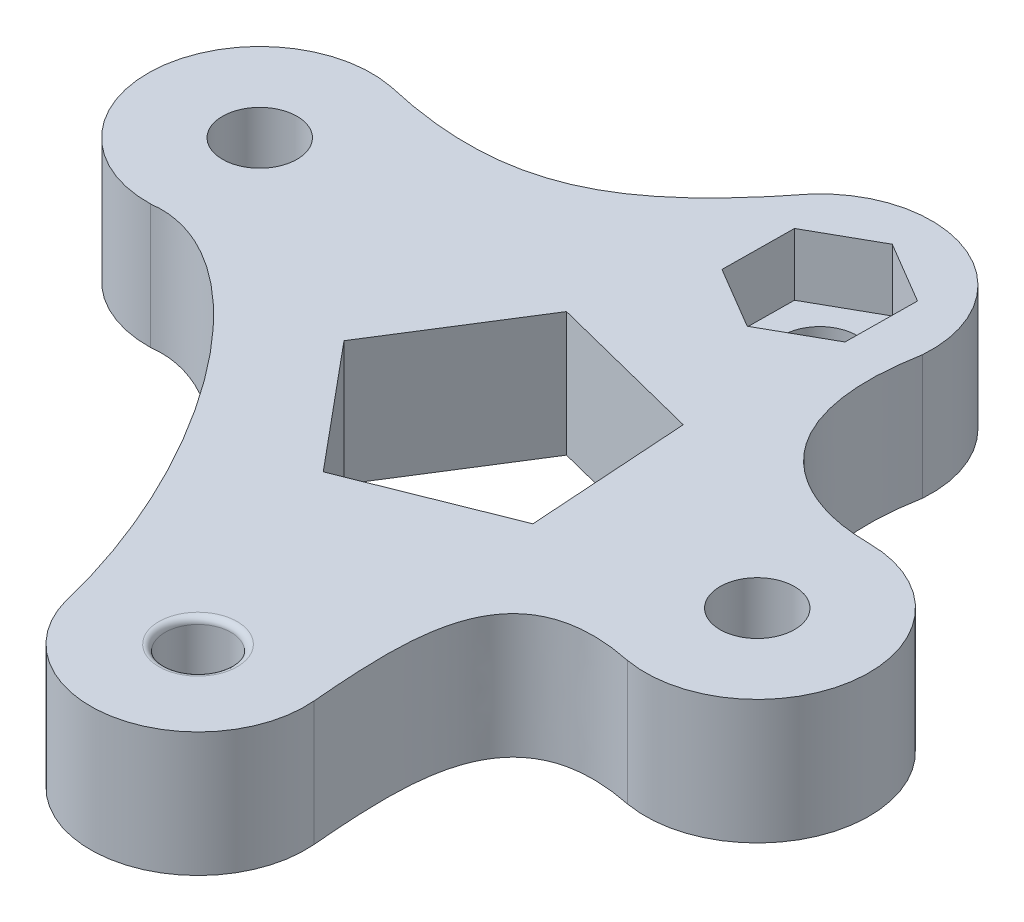
ISO-10303-21;
HEADER;
FILE_DESCRIPTION(('STEP AP214'),'2;1');
FILE_NAME('part.step','',(''),(''),'','','');
FILE_SCHEMA(('AUTOMOTIVE_DESIGN { 1 0 10303 214 1 1 1 1 }'));
ENDSEC;
DATA;
#1=APPLICATION_CONTEXT('core data for automotive mechanical design processes');
#2=APPLICATION_PROTOCOL_DEFINITION('international standard','automotive_design',2000,#1);
#3=PRODUCT_CONTEXT('',#1,'mechanical');
#4=PRODUCT('Part','Part','',(#3));
#5=PRODUCT_RELATED_PRODUCT_CATEGORY('part','',(#4));
#6=PRODUCT_DEFINITION_FORMATION('','',#4);
#7=PRODUCT_DEFINITION_CONTEXT('part definition',#1,'design');
#8=PRODUCT_DEFINITION('design','',#6,#7);
#9=PRODUCT_DEFINITION_SHAPE('','',#8);
#10=(LENGTH_UNIT() NAMED_UNIT(*) SI_UNIT(.MILLI.,.METRE.));
#11=(NAMED_UNIT(*) PLANE_ANGLE_UNIT() SI_UNIT($,.RADIAN.));
#12=(NAMED_UNIT(*) SI_UNIT($,.STERADIAN.) SOLID_ANGLE_UNIT());
#13=UNCERTAINTY_MEASURE_WITH_UNIT(LENGTH_MEASURE(1.E-05),#10,'distance_accuracy_value','');
#14=(GEOMETRIC_REPRESENTATION_CONTEXT(3) GLOBAL_UNCERTAINTY_ASSIGNED_CONTEXT((#13)) GLOBAL_UNIT_ASSIGNED_CONTEXT((#10,
#11,#12)) REPRESENTATION_CONTEXT('',''));
#15=CARTESIAN_POINT('',(0.,0.,0.));
#16=DIRECTION('',(0.,0.,1.));
#17=DIRECTION('',(1.,0.,0.));
#18=AXIS2_PLACEMENT_3D('',#15,#16,#17);
#19=CARTESIAN_POINT('',(0.,9.5,0.));
#20=DIRECTION('',(0.,1.,0.));
#21=DIRECTION('',(0.,0.,1.));
#22=AXIS2_PLACEMENT_3D('',#19,#20,#21);
#23=TOROIDAL_SURFACE('',#22,3.15,0.5);
#24=CARTESIAN_POINT('',(0.,10.,0.));
#25=DIRECTION('',(0.,1.,0.));
#26=DIRECTION('',(0.,0.,1.));
#27=AXIS2_PLACEMENT_3D('',#24,#25,#26);
#28=CIRCLE('',#27,3.15);
#29=CARTESIAN_POINT('',(0.,10.,3.15));
#30=VERTEX_POINT('',#29);
#31=EDGE_CURVE('E44',#30,#30,#28,.F.);
#32=ORIENTED_EDGE('',*,*,#31,.F.);
#33=EDGE_LOOP('',(#32));
#34=FACE_BOUND('',#33,.T.);
#35=CARTESIAN_POINT('',(0.,9.5,0.));
#36=DIRECTION('',(0.,1.,0.));
#37=DIRECTION('',(0.,0.,1.));
#38=AXIS2_PLACEMENT_3D('',#35,#36,#37);
#39=CIRCLE('',#38,2.65);
#40=CARTESIAN_POINT('',(0.,9.5,2.65));
#41=VERTEX_POINT('',#40);
#42=EDGE_CURVE('E11',#41,#41,#39,.T.);
#43=ORIENTED_EDGE('',*,*,#42,.F.);
#44=EDGE_LOOP('',(#43));
#45=FACE_BOUND('',#44,.T.);
#46=ADVANCED_FACE('F37',(#34,#45),#23,.T.);
#47=CARTESIAN_POINT('',(0.,0.5,0.));
#48=DIRECTION('',(0.,1.,0.));
#49=DIRECTION('',(0.,0.,1.));
#50=AXIS2_PLACEMENT_3D('',#47,#48,#49);
#51=TOROIDAL_SURFACE('',#50,3.15,0.5);
#52=CARTESIAN_POINT('',(0.,0.,0.));
#53=DIRECTION('',(0.,1.,0.));
#54=DIRECTION('',(0.,0.,1.));
#55=AXIS2_PLACEMENT_3D('',#52,#53,#54);
#56=CIRCLE('',#55,3.15);
#57=CARTESIAN_POINT('',(0.,0.,3.15));
#58=VERTEX_POINT('',#57);
#59=EDGE_CURVE('E252',#58,#58,#56,.T.);
#60=ORIENTED_EDGE('',*,*,#59,.F.);
#61=EDGE_LOOP('',(#60));
#62=FACE_BOUND('',#61,.T.);
#63=CARTESIAN_POINT('',(0.,0.5,0.));
#64=DIRECTION('',(0.,1.,0.));
#65=DIRECTION('',(0.,0.,1.));
#66=AXIS2_PLACEMENT_3D('',#63,#64,#65);
#67=CIRCLE('',#66,2.65);
#68=CARTESIAN_POINT('',(0.,0.5,2.65));
#69=VERTEX_POINT('',#68);
#70=EDGE_CURVE('E274',#69,#69,#67,.F.);
#71=ORIENTED_EDGE('',*,*,#70,.F.);
#72=EDGE_LOOP('',(#71));
#73=FACE_BOUND('',#72,.T.);
#74=ADVANCED_FACE('F283',(#62,#73),#51,.T.);
#75=CARTESIAN_POINT('',(0.,10.,-50.));
#76=DIRECTION('',(0.,-1.,0.));
#77=DIRECTION('',(0.,0.,-1.));
#78=AXIS2_PLACEMENT_3D('',#75,#76,#77);
#79=CYLINDRICAL_SURFACE('',#78,3.);
#80=CARTESIAN_POINT('',(0.,0.,-50.));
#81=DIRECTION('',(0.,1.,0.));
#82=DIRECTION('',(0.,0.,1.));
#83=AXIS2_PLACEMENT_3D('',#80,#81,#82);
#84=CIRCLE('',#83,3.);
#85=CARTESIAN_POINT('',(0.,0.,-47.));
#86=VERTEX_POINT('',#85);
#87=EDGE_CURVE('E240',#86,#86,#84,.T.);
#88=ORIENTED_EDGE('',*,*,#87,.F.);
#89=EDGE_LOOP('',(#88));
#90=FACE_BOUND('',#89,.T.);
#91=CARTESIAN_POINT('',(0.,5.,-50.));
#92=DIRECTION('',(0.,1.,0.));
#93=DIRECTION('',(0.,0.,1.));
#94=AXIS2_PLACEMENT_3D('',#91,#92,#93);
#95=CIRCLE('',#94,3.);
#96=CARTESIAN_POINT('',(0.,5.,-47.));
#97=VERTEX_POINT('',#96);
#98=EDGE_CURVE('E189',#97,#97,#95,.T.);
#99=ORIENTED_EDGE('',*,*,#98,.T.);
#100=EDGE_LOOP('',(#99));
#101=FACE_BOUND('',#100,.T.);
#102=ADVANCED_FACE('F295',(#90,#101),#79,.F.);
#103=CARTESIAN_POINT('',(6.49848751845895,10.,-0.429456596579437));
#104=DIRECTION('',(-0.997823471803011,0.,0.0659417858340704));
#105=DIRECTION('',(0.0659417858340704,0.,0.997823471803011));
#106=AXIS2_PLACEMENT_3D('',#103,#104,#105);
#107=PLANE('',#106);
#108=DIRECTION('',(-0.0659417858340704,0.,-0.997823471803011));
#109=VECTOR('',#108,1.);
#110=CARTESIAN_POINT('',(6.49848751845895,0.,-0.429456596579437));
#111=LINE('',#110,#109);
#112=CARTESIAN_POINT('',(5.08295150552818,0.,-21.8491837243666));
#113=VERTEX_POINT('',#112);
#114=CARTESIAN_POINT('',(4.22740424267535,0.,-34.7952258934323));
#115=VERTEX_POINT('',#114);
#116=EDGE_CURVE('E229',#113,#115,#111,.T.);
#117=ORIENTED_EDGE('',*,*,#116,.F.);
#118=DIRECTION('',(0.,-1.,0.));
#119=VECTOR('',#118,1.);
#120=CARTESIAN_POINT('',(5.08295150552818,10.,-21.8491837243666));
#121=LINE('',#120,#119);
#122=CARTESIAN_POINT('',(5.08295150552818,10.,-21.8491837243666));
#123=VERTEX_POINT('',#122);
#124=EDGE_CURVE('E250',#123,#113,#121,.T.);
#125=ORIENTED_EDGE('',*,*,#124,.F.);
#126=DIRECTION('',(-0.0659417858340704,0.,-0.997823471803011));
#127=VECTOR('',#126,1.);
#128=CARTESIAN_POINT('',(6.49848751845895,10.,-0.429456596579437));
#129=LINE('',#128,#127);
#130=CARTESIAN_POINT('',(4.22740424267535,10.,-34.7952258934323));
#131=VERTEX_POINT('',#130);
#132=EDGE_CURVE('E518',#123,#131,#129,.T.);
#133=ORIENTED_EDGE('',*,*,#132,.T.);
#134=DIRECTION('',(0.,-1.,0.));
#135=VECTOR('',#134,1.);
#136=CARTESIAN_POINT('',(4.22740424267535,10.,-34.7952258934323));
#137=LINE('',#136,#135);
#138=EDGE_CURVE('E60',#131,#115,#137,.T.);
#139=ORIENTED_EDGE('',*,*,#138,.T.);
#140=EDGE_LOOP('',(#117,#125,#133,#139));
#141=FACE_BOUND('',#140,.T.);
#142=ADVANCED_FACE('F300',(#141),#107,.T.);
#143=CARTESIAN_POINT('',(-6.82869974256127,10.,-17.0894614912974));
#144=DIRECTION('',(-0.371058775286974,0.,-0.928609382508346));
#145=DIRECTION('',(-0.928609382508346,0.,0.371058775286974));
#146=AXIS2_PLACEMENT_3D('',#143,#144,#145);
#147=PLANE('',#146);
#148=DIRECTION('',(0.928609382508346,0.,-0.371058775286974));
#149=VECTOR('',#148,1.);
#150=CARTESIAN_POINT('',(-6.82869974256127,0.,-17.0894614912974));
#151=LINE('',#150,#149);
#152=CARTESIAN_POINT('',(-6.96508761588114,0.,-17.0349628848959));
#153=VERTEX_POINT('',#152);
#154=EDGE_CURVE('E231',#153,#113,#151,.T.);
#155=ORIENTED_EDGE('',*,*,#154,.F.);
#156=DIRECTION('',(0.,-1.,0.));
#157=VECTOR('',#156,1.);
#158=CARTESIAN_POINT('',(-6.96508761588114,10.,-17.0349628848959));
#159=LINE('',#158,#157);
#160=CARTESIAN_POINT('',(-6.96508761588114,10.,-17.0349628848959));
#161=VERTEX_POINT('',#160);
#162=EDGE_CURVE('E159',#161,#153,#159,.T.);
#163=ORIENTED_EDGE('',*,*,#162,.F.);
#164=DIRECTION('',(0.928609382508346,0.,-0.371058775286974));
#165=VECTOR('',#164,1.);
#166=CARTESIAN_POINT('',(-6.82869974256127,10.,-17.0894614912974));
#167=LINE('',#166,#165);
#168=EDGE_CURVE('E171',#161,#123,#167,.T.);
#169=ORIENTED_EDGE('',*,*,#168,.T.);
#170=ORIENTED_EDGE('',*,*,#124,.T.);
#171=EDGE_LOOP('',(#155,#163,#169,#170));
#172=FACE_BOUND('',#171,.T.);
#173=ADVANCED_FACE('F383',(#172),#147,.T.);
#174=CARTESIAN_POINT('',(4.26303666465518,10.,-3.54942501772673));
#175=DIRECTION('',(0.768496536851751,0.,-0.63985394649628));
#176=DIRECTION('',(-0.63985394649628,0.,-0.768496536851751));
#177=AXIS2_PLACEMENT_3D('',#174,#175,#176);
#178=PLANE('',#177);
#179=DIRECTION('',(0.63985394649628,0.,0.768496536851751));
#180=VECTOR('',#179,1.);
#181=CARTESIAN_POINT('',(4.26303666465518,0.,-3.54942501772673));
#182=LINE('',#181,#180);
#183=CARTESIAN_POINT('',(-15.2667325535534,0.,-27.0056529458207));
#184=VERTEX_POINT('',#183);
#185=EDGE_CURVE('E154',#184,#153,#182,.T.);
#186=ORIENTED_EDGE('',*,*,#185,.F.);
#187=DIRECTION('',(0.,-1.,0.));
#188=VECTOR('',#187,1.);
#189=CARTESIAN_POINT('',(-15.2667325535534,10.,-27.0056529458207));
#190=LINE('',#189,#188);
#191=CARTESIAN_POINT('',(-15.2667325535534,10.,-27.0056529458207));
#192=VERTEX_POINT('',#191);
#193=EDGE_CURVE('E149',#192,#184,#190,.T.);
#194=ORIENTED_EDGE('',*,*,#193,.F.);
#195=DIRECTION('',(0.63985394649628,0.,0.768496536851751));
#196=VECTOR('',#195,1.);
#197=CARTESIAN_POINT('',(4.26303666465518,10.,-3.54942501772673));
#198=LINE('',#197,#196);
#199=EDGE_CURVE('E152',#192,#161,#198,.T.);
#200=ORIENTED_EDGE('',*,*,#199,.T.);
#201=ORIENTED_EDGE('',*,*,#162,.T.);
#202=EDGE_LOOP('',(#186,#194,#200,#201));
#203=FACE_BOUND('',#202,.T.);
#204=ADVANCED_FACE('F151',(#203),#178,.T.);
#205=CARTESIAN_POINT('',(-23.1082210138306,10.,-14.5627671976878));
#206=DIRECTION('',(0.846015755297943,0.,0.533157895737887));
#207=DIRECTION('',(0.533157895737887,0.,-0.846015755297943));
#208=AXIS2_PLACEMENT_3D('',#205,#206,#207);
#209=PLANE('',#208);
#210=DIRECTION('',(-0.533157895737887,0.,0.846015755297943));
#211=VECTOR('',#210,1.);
#212=CARTESIAN_POINT('',(-23.1082210138306,0.,-14.5627671976878));
#213=LINE('',#212,#211);
#214=CARTESIAN_POINT('',(-8.34939216615898,0.,-37.9820991342337));
#215=VERTEX_POINT('',#214);
#216=EDGE_CURVE('E235',#215,#184,#213,.T.);
#217=ORIENTED_EDGE('',*,*,#216,.F.);
#218=DIRECTION('',(0.,-1.,0.));
#219=VECTOR('',#218,1.);
#220=CARTESIAN_POINT('',(-8.34939216615898,10.,-37.9820991342337));
#221=LINE('',#220,#219);
#222=CARTESIAN_POINT('',(-8.34939216615898,10.,-37.9820991342337));
#223=VERTEX_POINT('',#222);
#224=EDGE_CURVE('E160',#223,#215,#221,.T.);
#225=ORIENTED_EDGE('',*,*,#224,.F.);
#226=DIRECTION('',(-0.533157895737887,0.,0.846015755297943));
#227=VECTOR('',#226,1.);
#228=CARTESIAN_POINT('',(-23.1082210138306,10.,-14.5627671976878));
#229=LINE('',#228,#227);
#230=EDGE_CURVE('E169',#223,#192,#229,.T.);
#231=ORIENTED_EDGE('',*,*,#230,.T.);
#232=ORIENTED_EDGE('',*,*,#193,.T.);
#233=EDGE_LOOP('',(#217,#225,#231,#232));
#234=FACE_BOUND('',#233,.T.);
#235=ADVANCED_FACE('F173',(#234),#209,.T.);
#236=CARTESIAN_POINT('',(18.4152010642432,10.,-16.1361929124947));
#237=CARTESIAN_POINT('',(8.09980421145363,10.,-18.2782159029591));
#238=CARTESIAN_POINT('',(7.88377715331091,10.,-5.86827617151024));
#239=CARTESIAN_POINT('',(9.15507635758057,10.,4.83149193183385));
#240=CARTESIAN_POINT('',(10.8046231713954,10.,6.29322049876016));
#241=B_SPLINE_CURVE_WITH_KNOTS('',3,(#236,#237,#238,#239,#240),.UNSPECIFIED.,.F.,.F.,(4,1,4),
(0.,0.640184331831748,1.),.UNSPECIFIED.);
#242=DIRECTION('',(0.,-1.,0.));
#243=VECTOR('',#242,1.);
#244=SURFACE_OF_LINEAR_EXTRUSION('',#241,#243);
#245=CARTESIAN_POINT('',(18.4152010642432,0.,-16.1361929124947));
#246=CARTESIAN_POINT('',(8.09980421145363,0.,-18.2782159029591));
#247=CARTESIAN_POINT('',(7.88377715331091,0.,-5.86827617151024));
#248=CARTESIAN_POINT('',(9.15507635758057,0.,4.83149193183385));
#249=CARTESIAN_POINT('',(10.8046231713954,0.,6.29322049876016));
#250=B_SPLINE_CURVE_WITH_KNOTS('',3,(#245,#246,#247,#248,#249),.UNSPECIFIED.,.F.,.F.,(4,1,4),
(0.,0.640184331831748,1.),.UNSPECIFIED.);
#251=CARTESIAN_POINT('',(18.4152010642432,0.,-16.1361929124947));
#252=VERTEX_POINT('',#251);
#253=CARTESIAN_POINT('',(8.62015601704226,0.,-0.7179207768621));
#254=VERTEX_POINT('',#253);
#255=EDGE_CURVE('E183',#252,#254,#250,.T.);
#256=ORIENTED_EDGE('',*,*,#255,.F.);
#257=DIRECTION('',(0.,-1.,0.));
#258=VECTOR('',#257,1.);
#259=CARTESIAN_POINT('',(18.4152010642432,10.,-16.1361929124947));
#260=LINE('',#259,#258);
#261=CARTESIAN_POINT('',(18.4152010642432,10.,-16.1361929124947));
#262=VERTEX_POINT('',#261);
#263=EDGE_CURVE('E114',#262,#252,#260,.T.);
#264=ORIENTED_EDGE('',*,*,#263,.F.);
#265=CARTESIAN_POINT('',(8.62015601704226,10.,-0.7179207768621));
#266=VERTEX_POINT('',#265);
#267=EDGE_CURVE('E246',#262,#266,#241,.T.);
#268=ORIENTED_EDGE('',*,*,#267,.T.);
#269=DIRECTION('',(0.,-1.,0.));
#270=VECTOR('',#269,1.);
#271=CARTESIAN_POINT('',(8.62015601704226,10.,-0.7179207768621));
#272=LINE('',#271,#270);
#273=EDGE_CURVE('E182',#266,#254,#272,.T.);
#274=ORIENTED_EDGE('',*,*,#273,.T.);
#275=EDGE_LOOP('',(#256,#264,#268,#274));
#276=FACE_BOUND('',#275,.T.);
#277=ADVANCED_FACE('F305',(#276),#244,.T.);
#278=CARTESIAN_POINT('',(19.9749843554382,10.,-25.));
#279=DIRECTION('',(0.,-1.,0.));
#280=DIRECTION('',(0.,0.,-1.));
#281=AXIS2_PLACEMENT_3D('',#278,#279,#280);
#282=CYLINDRICAL_SURFACE('',#281,9.00000000000001);
#283=CARTESIAN_POINT('',(19.9749843554382,0.,-25.));
#284=DIRECTION('',(0.,1.,0.));
#285=DIRECTION('',(0.,0.,1.));
#286=AXIS2_PLACEMENT_3D('',#283,#284,#285);
#287=CIRCLE('',#286,9.00000000000001);
#288=CARTESIAN_POINT('',(20.0239779604949,0.,-33.9998666449378));
#289=VERTEX_POINT('',#288);
#290=EDGE_CURVE('E188',#252,#289,#287,.T.);
#291=ORIENTED_EDGE('',*,*,#290,.T.);
#292=DIRECTION('',(0.,-1.,0.));
#293=VECTOR('',#292,1.);
#294=CARTESIAN_POINT('',(20.0239779604949,10.,-33.9998666449378));
#295=LINE('',#294,#293);
#296=CARTESIAN_POINT('',(20.0239779604949,10.,-33.9998666449378));
#297=VERTEX_POINT('',#296);
#298=EDGE_CURVE('E266',#297,#289,#295,.T.);
#299=ORIENTED_EDGE('',*,*,#298,.F.);
#300=CARTESIAN_POINT('',(19.9749843554382,10.,-25.));
#301=DIRECTION('',(0.,1.,0.));
#302=DIRECTION('',(0.,0.,1.));
#303=AXIS2_PLACEMENT_3D('',#300,#301,#302);
#304=CIRCLE('',#303,9.00000000000001);
#305=EDGE_CURVE('E316',#262,#297,#304,.T.);
#306=ORIENTED_EDGE('',*,*,#305,.F.);
#307=ORIENTED_EDGE('',*,*,#263,.T.);
#308=EDGE_LOOP('',(#291,#299,#306,#307));
#309=FACE_BOUND('',#308,.T.);
#310=ADVANCED_FACE('F309',(#309),#282,.T.);
#311=CARTESIAN_POINT('',(8.97317785185828,10.,-49.305680737038));
#312=CARTESIAN_POINT('',(5.49328523217848,10.,-30.5596956335202));
#313=CARTESIAN_POINT('',(26.2667020325121,10.,-31.3291109601468));
#314=CARTESIAN_POINT('',(32.1070484161927,10.,-39.4155715811322));
#315=B_SPLINE_CURVE_WITH_KNOTS('',3,(#311,#312,#313,#314),.UNSPECIFIED.,.F.,.F.,(4,4),(0.,1.),.UNSPECIFIED.);
#316=DIRECTION('',(0.,-1.,0.));
#317=VECTOR('',#316,1.);
#318=SURFACE_OF_LINEAR_EXTRUSION('',#315,#317);
#319=CARTESIAN_POINT('',(8.97317785185828,0.,-49.305680737038));
#320=CARTESIAN_POINT('',(5.49328523217848,0.,-30.5596956335202));
#321=CARTESIAN_POINT('',(26.2667020325121,0.,-31.3291109601468));
#322=CARTESIAN_POINT('',(32.1070484161927,0.,-39.4155715811322));
#323=B_SPLINE_CURVE_WITH_KNOTS('',3,(#319,#320,#321,#322),.UNSPECIFIED.,.F.,.F.,(4,4),(0.,1.),.UNSPECIFIED.);
#324=CARTESIAN_POINT('',(8.97317785185827,0.,-49.305680737038));
#325=VERTEX_POINT('',#324);
#326=EDGE_CURVE('E195',#325,#289,#323,.T.);
#327=ORIENTED_EDGE('',*,*,#326,.F.);
#328=DIRECTION('',(0.,-1.,0.));
#329=VECTOR('',#328,1.);
#330=CARTESIAN_POINT('',(8.97317785185827,10.,-49.305680737038));
#331=LINE('',#330,#329);
#332=CARTESIAN_POINT('',(8.97317785185827,10.,-49.305680737038));
#333=VERTEX_POINT('',#332);
#334=EDGE_CURVE('E264',#333,#325,#331,.T.);
#335=ORIENTED_EDGE('',*,*,#334,.F.);
#336=EDGE_CURVE('E323',#333,#297,#315,.T.);
#337=ORIENTED_EDGE('',*,*,#336,.T.);
#338=ORIENTED_EDGE('',*,*,#298,.T.);
#339=EDGE_LOOP('',(#327,#335,#337,#338));
#340=FACE_BOUND('',#339,.T.);
#341=ADVANCED_FACE('F334',(#340),#318,.T.);
#342=CARTESIAN_POINT('',(0.,10.,-50.));
#343=DIRECTION('',(0.,-1.,0.));
#344=DIRECTION('',(0.,0.,-1.));
#345=AXIS2_PLACEMENT_3D('',#342,#343,#344);
#346=CYLINDRICAL_SURFACE('',#345,9.);
#347=CARTESIAN_POINT('',(0.,0.,-50.));
#348=DIRECTION('',(0.,1.,0.));
#349=DIRECTION('',(0.,0.,1.));
#350=AXIS2_PLACEMENT_3D('',#347,#348,#349);
#351=CIRCLE('',#350,9.);
#352=CARTESIAN_POINT('',(-6.65608852670844,0.,-56.0577624189646));
#353=VERTEX_POINT('',#352);
#354=EDGE_CURVE('E200',#325,#353,#351,.T.);
#355=ORIENTED_EDGE('',*,*,#354,.T.);
#356=DIRECTION('',(0.,-1.,0.));
#357=VECTOR('',#356,1.);
#358=CARTESIAN_POINT('',(-6.65608852670844,10.,-56.0577624189646));
#359=LINE('',#358,#357);
#360=CARTESIAN_POINT('',(-6.65608852670844,10.,-56.0577624189646));
#361=VERTEX_POINT('',#360);
#362=EDGE_CURVE('E262',#361,#353,#359,.T.);
#363=ORIENTED_EDGE('',*,*,#362,.F.);
#364=CARTESIAN_POINT('',(0.,10.,-50.));
#365=DIRECTION('',(0.,1.,0.));
#366=DIRECTION('',(0.,0.,1.));
#367=AXIS2_PLACEMENT_3D('',#364,#365,#366);
#368=CIRCLE('',#367,9.);
#369=EDGE_CURVE('E329',#333,#361,#368,.T.);
#370=ORIENTED_EDGE('',*,*,#369,.F.);
#371=ORIENTED_EDGE('',*,*,#334,.T.);
#372=EDGE_LOOP('',(#355,#363,#370,#371));
#373=FACE_BOUND('',#372,.T.);
#374=ADVANCED_FACE('F337',(#373),#346,.T.);
#375=CARTESIAN_POINT('',(-31.0867246453892,10.,-46.5880795022187));
#376=CARTESIAN_POINT('',(-19.7895746511196,10.,-43.9491521286999));
#377=CARTESIAN_POINT('',(-11.9536081400962,10.,-48.5909069902257));
#378=CARTESIAN_POINT('',(-3.83565772654311,10.,-59.6537636698233));
#379=CARTESIAN_POINT('',(-2.95287471984913,10.,-63.3683133100101));
#380=B_SPLINE_CURVE_WITH_KNOTS('',3,(#375,#376,#377,#378,#379),.UNSPECIFIED.,.F.,.F.,(4,1,4),
(0.,0.709310605275663,1.),.UNSPECIFIED.);
#381=DIRECTION('',(0.,-1.,0.));
#382=VECTOR('',#381,1.);
#383=SURFACE_OF_LINEAR_EXTRUSION('',#380,#382);
#384=CARTESIAN_POINT('',(-31.0867246453892,0.,-46.5880795022187));
#385=CARTESIAN_POINT('',(-19.7895746511196,0.,-43.9491521286999));
#386=CARTESIAN_POINT('',(-11.9536081400962,0.,-48.5909069902257));
#387=CARTESIAN_POINT('',(-3.83565772654311,0.,-59.6537636698233));
#388=CARTESIAN_POINT('',(-2.95287471984913,0.,-63.3683133100101));
#389=B_SPLINE_CURVE_WITH_KNOTS('',3,(#384,#385,#386,#387,#388),.UNSPECIFIED.,.F.,.F.,(4,1,4),
(0.,0.709310605275663,1.),.UNSPECIFIED.);
#390=CARTESIAN_POINT('',(-31.0867246453892,0.,-46.5880795022187));
#391=VERTEX_POINT('',#390);
#392=EDGE_CURVE('E206',#391,#353,#389,.T.);
#393=ORIENTED_EDGE('',*,*,#392,.F.);
#394=DIRECTION('',(0.,-1.,0.));
#395=VECTOR('',#394,1.);
#396=CARTESIAN_POINT('',(-31.0867246453892,10.,-46.5880795022187));
#397=LINE('',#396,#395);
#398=CARTESIAN_POINT('',(-31.0867246453892,10.,-46.5880795022187));
#399=VERTEX_POINT('',#398);
#400=EDGE_CURVE('E260',#399,#391,#397,.T.);
#401=ORIENTED_EDGE('',*,*,#400,.F.);
#402=EDGE_CURVE('E348',#399,#361,#380,.T.);
#403=ORIENTED_EDGE('',*,*,#402,.T.);
#404=ORIENTED_EDGE('',*,*,#362,.T.);
#405=EDGE_LOOP('',(#393,#401,#403,#404));
#406=FACE_BOUND('',#405,.T.);
#407=ADVANCED_FACE('F341',(#406),#383,.T.);
#408=CARTESIAN_POINT('',(-32.7862394915916,10.,-37.75));
#409=DIRECTION('',(0.,-1.,0.));
#410=DIRECTION('',(0.,0.,-1.));
#411=AXIS2_PLACEMENT_3D('',#408,#409,#410);
#412=CYLINDRICAL_SURFACE('',#411,9.);
#413=CARTESIAN_POINT('',(-32.7862394915916,0.,-37.75));
#414=DIRECTION('',(0.,1.,0.));
#415=DIRECTION('',(0.,0.,1.));
#416=AXIS2_PLACEMENT_3D('',#413,#414,#415);
#417=CIRCLE('',#416,9.);
#418=CARTESIAN_POINT('',(-32.5594886375921,0.,-28.7528568950911));
#419=VERTEX_POINT('',#418);
#420=EDGE_CURVE('E211',#391,#419,#417,.T.);
#421=ORIENTED_EDGE('',*,*,#420,.T.);
#422=DIRECTION('',(0.,-1.,0.));
#423=VECTOR('',#422,1.);
#424=CARTESIAN_POINT('',(-32.5594886375921,10.,-28.7528568950911));
#425=LINE('',#424,#423);
#426=CARTESIAN_POINT('',(-32.5594886375921,10.,-28.7528568950911));
#427=VERTEX_POINT('',#426);
#428=EDGE_CURVE('E257',#427,#419,#425,.T.);
#429=ORIENTED_EDGE('',*,*,#428,.F.);
#430=CARTESIAN_POINT('',(-32.7862394915916,10.,-37.75));
#431=DIRECTION('',(0.,1.,0.));
#432=DIRECTION('',(0.,0.,1.));
#433=AXIS2_PLACEMENT_3D('',#430,#431,#432);
#434=CIRCLE('',#433,9.);
#435=EDGE_CURVE('E354',#399,#427,#434,.T.);
#436=ORIENTED_EDGE('',*,*,#435,.F.);
#437=ORIENTED_EDGE('',*,*,#400,.T.);
#438=EDGE_LOOP('',(#421,#429,#436,#437));
#439=FACE_BOUND('',#438,.T.);
#440=ADVANCED_FACE('F345',(#439),#412,.T.);
#441=CARTESIAN_POINT('',(-32.5594886375921,10.,-28.7528568950911));
#442=CARTESIAN_POINT('',(-22.2479273622609,10.,-30.181939372049));
#443=CARTESIAN_POINT('',(-5.43364175966254,10.,-3.44947014054236));
#444=CARTESIAN_POINT('',(-7.48972259740143,10.,13.3840966396793));
#445=B_SPLINE_CURVE_WITH_KNOTS('',3,(#441,#442,#443,#444),.UNSPECIFIED.,.F.,.F.,(4,4),(0.,1.),.UNSPECIFIED.);
#446=DIRECTION('',(0.,-1.,0.));
#447=VECTOR('',#446,1.);
#448=SURFACE_OF_LINEAR_EXTRUSION('',#445,#447);
#449=CARTESIAN_POINT('',(-32.5594886375921,0.,-28.7528568950911));
#450=CARTESIAN_POINT('',(-22.2479273622609,0.,-30.181939372049));
#451=CARTESIAN_POINT('',(-5.43364175966254,0.,-3.44947014054236));
#452=CARTESIAN_POINT('',(-7.48972259740143,0.,13.3840966396793));
#453=B_SPLINE_CURVE_WITH_KNOTS('',3,(#449,#450,#451,#452),.UNSPECIFIED.,.F.,.F.,(4,4),(0.,1.),.UNSPECIFIED.);
#454=CARTESIAN_POINT('',(-8.356742025347,0.,2.23324040841989));
#455=VERTEX_POINT('',#454);
#456=EDGE_CURVE('E216',#419,#455,#453,.T.);
#457=ORIENTED_EDGE('',*,*,#456,.T.);
#458=DIRECTION('',(0.,-1.,0.));
#459=VECTOR('',#458,1.);
#460=CARTESIAN_POINT('',(-8.356742025347,10.,2.23324040841989));
#461=LINE('',#460,#459);
#462=CARTESIAN_POINT('',(-8.356742025347,10.,2.23324040841989));
#463=VERTEX_POINT('',#462);
#464=EDGE_CURVE('E254',#463,#455,#461,.T.);
#465=ORIENTED_EDGE('',*,*,#464,.F.);
#466=EDGE_CURVE('E359',#427,#463,#445,.T.);
#467=ORIENTED_EDGE('',*,*,#466,.F.);
#468=ORIENTED_EDGE('',*,*,#428,.T.);
#469=EDGE_LOOP('',(#457,#465,#467,#468));
#470=FACE_BOUND('',#469,.T.);
#471=ADVANCED_FACE('F290',(#470),#448,.F.);
#472=CARTESIAN_POINT('',(0.,10.,0.));
#473=DIRECTION('',(0.,-1.,0.));
#474=DIRECTION('',(0.,0.,-1.));
#475=AXIS2_PLACEMENT_3D('',#472,#473,#474);
#476=CYLINDRICAL_SURFACE('',#475,2.65);
#477=ORIENTED_EDGE('',*,*,#42,.T.);
#478=EDGE_LOOP('',(#477));
#479=FACE_BOUND('',#478,.T.);
#480=ORIENTED_EDGE('',*,*,#70,.T.);
#481=EDGE_LOOP('',(#480));
#482=FACE_BOUND('',#481,.T.);
#483=ADVANCED_FACE('F286',(#479,#482),#476,.F.);
#484=CARTESIAN_POINT('',(8.53996827958272,10.,-33.7024519880832));
#485=DIRECTION('',(-0.24563004505971,0.,0.969363647432668));
#486=DIRECTION('',(0.969363647432668,0.,0.24563004505971));
#487=AXIS2_PLACEMENT_3D('',#484,#485,#486);
#488=PLANE('',#487);
#489=DIRECTION('',(-0.969363647432668,0.,-0.24563004505971));
#490=VECTOR('',#489,1.);
#491=CARTESIAN_POINT('',(8.53996827958272,0.,-33.7024519880832));
#492=LINE('',#491,#490);
#493=EDGE_CURVE('E237',#115,#215,#492,.T.);
#494=ORIENTED_EDGE('',*,*,#493,.F.);
#495=ORIENTED_EDGE('',*,*,#138,.F.);
#496=DIRECTION('',(-0.969363647432668,0.,-0.24563004505971));
#497=VECTOR('',#496,1.);
#498=CARTESIAN_POINT('',(8.53996827958272,10.,-33.7024519880832));
#499=LINE('',#498,#497);
#500=EDGE_CURVE('E174',#131,#223,#499,.T.);
#501=ORIENTED_EDGE('',*,*,#500,.T.);
#502=ORIENTED_EDGE('',*,*,#224,.T.);
#503=EDGE_LOOP('',(#494,#495,#501,#502));
#504=FACE_BOUND('',#503,.T.);
#505=ADVANCED_FACE('F289',(#504),#488,.T.);
#506=CARTESIAN_POINT('',(-32.7862394915916,10.,-37.75));
#507=DIRECTION('',(0.,-1.,0.));
#508=DIRECTION('',(0.,0.,-1.));
#509=AXIS2_PLACEMENT_3D('',#506,#507,#508);
#510=CYLINDRICAL_SURFACE('',#509,3.);
#511=CARTESIAN_POINT('',(-32.7862394915916,10.,-37.75));
#512=DIRECTION('',(0.,1.,0.));
#513=DIRECTION('',(0.,0.,1.));
#514=AXIS2_PLACEMENT_3D('',#511,#512,#513);
#515=CIRCLE('',#514,3.);
#516=CARTESIAN_POINT('',(-32.7862394915916,10.,-34.75));
#517=VERTEX_POINT('',#516);
#518=EDGE_CURVE('E517',#517,#517,#515,.T.);
#519=ORIENTED_EDGE('',*,*,#518,.T.);
#520=EDGE_LOOP('',(#519));
#521=FACE_BOUND('',#520,.T.);
#522=CARTESIAN_POINT('',(-32.7862394915916,0.,-37.75));
#523=DIRECTION('',(0.,1.,0.));
#524=DIRECTION('',(0.,0.,1.));
#525=AXIS2_PLACEMENT_3D('',#522,#523,#524);
#526=CIRCLE('',#525,3.);
#527=CARTESIAN_POINT('',(-32.7862394915916,0.,-34.75));
#528=VERTEX_POINT('',#527);
#529=EDGE_CURVE('E226',#528,#528,#526,.T.);
#530=ORIENTED_EDGE('',*,*,#529,.F.);
#531=EDGE_LOOP('',(#530));
#532=FACE_BOUND('',#531,.T.);
#533=ADVANCED_FACE('F376',(#521,#532),#510,.F.);
#534=CARTESIAN_POINT('',(0.,10.,0.));
#535=DIRECTION('',(0.,-1.,0.));
#536=DIRECTION('',(0.,0.,-1.));
#537=AXIS2_PLACEMENT_3D('',#534,#535,#536);
#538=CYLINDRICAL_SURFACE('',#537,8.65000000000001);
#539=CARTESIAN_POINT('',(0.,0.,0.));
#540=DIRECTION('',(0.,1.,0.));
#541=DIRECTION('',(0.,0.,1.));
#542=AXIS2_PLACEMENT_3D('',#539,#540,#541);
#543=CIRCLE('',#542,8.65000000000001);
#544=EDGE_CURVE('E220',#455,#254,#543,.T.);
#545=ORIENTED_EDGE('',*,*,#544,.T.);
#546=ORIENTED_EDGE('',*,*,#273,.F.);
#547=CARTESIAN_POINT('',(0.,10.,0.));
#548=DIRECTION('',(0.,1.,0.));
#549=DIRECTION('',(0.,0.,1.));
#550=AXIS2_PLACEMENT_3D('',#547,#548,#549);
#551=CIRCLE('',#550,8.65000000000001);
#552=EDGE_CURVE('E364',#463,#266,#551,.T.);
#553=ORIENTED_EDGE('',*,*,#552,.F.);
#554=ORIENTED_EDGE('',*,*,#464,.T.);
#555=EDGE_LOOP('',(#545,#546,#553,#554));
#556=FACE_BOUND('',#555,.T.);
#557=ADVANCED_FACE('F372',(#556),#538,.T.);
#558=CARTESIAN_POINT('',(19.9749843554382,10.,-25.));
#559=DIRECTION('',(0.,-1.,0.));
#560=DIRECTION('',(0.,0.,-1.));
#561=AXIS2_PLACEMENT_3D('',#558,#559,#560);
#562=CYLINDRICAL_SURFACE('',#561,3.);
#563=CARTESIAN_POINT('',(19.9749843554382,10.,-25.));
#564=DIRECTION('',(0.,1.,0.));
#565=DIRECTION('',(0.,0.,1.));
#566=AXIS2_PLACEMENT_3D('',#563,#564,#565);
#567=CIRCLE('',#566,3.);
#568=CARTESIAN_POINT('',(19.9749843554382,10.,-22.));
#569=VERTEX_POINT('',#568);
#570=EDGE_CURVE('E176',#569,#569,#567,.T.);
#571=ORIENTED_EDGE('',*,*,#570,.T.);
#572=EDGE_LOOP('',(#571));
#573=FACE_BOUND('',#572,.T.);
#574=CARTESIAN_POINT('',(19.9749843554382,0.,-25.));
#575=DIRECTION('',(0.,1.,0.));
#576=DIRECTION('',(0.,0.,1.));
#577=AXIS2_PLACEMENT_3D('',#574,#575,#576);
#578=CIRCLE('',#577,3.);
#579=CARTESIAN_POINT('',(19.9749843554382,0.,-22.));
#580=VERTEX_POINT('',#579);
#581=EDGE_CURVE('E243',#580,#580,#578,.T.);
#582=ORIENTED_EDGE('',*,*,#581,.F.);
#583=EDGE_LOOP('',(#582));
#584=FACE_BOUND('',#583,.T.);
#585=ADVANCED_FACE('F375',(#573,#584),#562,.F.);
#586=CARTESIAN_POINT('',(0.,10.,0.));
#587=DIRECTION('',(0.,1.,0.));
#588=DIRECTION('',(0.,0.,1.));
#589=AXIS2_PLACEMENT_3D('',#586,#587,#588);
#590=PLANE('',#589);
#591=ORIENTED_EDGE('',*,*,#31,.T.);
#592=EDGE_LOOP('',(#591));
#593=FACE_BOUND('',#592,.T.);
#594=DIRECTION('',(0.0105801449225257,0.,-0.999944028700316));
#595=VECTOR('',#594,1.);
#596=CARTESIAN_POINT('',(4.96917789590616,10.,-47.0605095046639));
#597=LINE('',#596,#595);
#598=CARTESIAN_POINT('',(4.96917789590616,10.,-47.0605095046639));
#599=VERTEX_POINT('',#598);
#600=CARTESIAN_POINT('',(5.03026239109701,10.,-52.8336890461108));
#601=VERTEX_POINT('',#600);
#602=EDGE_CURVE('E51',#599,#601,#597,.T.);
#603=ORIENTED_EDGE('',*,*,#602,.F.);
#604=DIRECTION('',(0.871267003678293,0.,-0.490809340071529));
#605=VECTOR('',#604,1.);
#606=CARTESIAN_POINT('',(-0.0610844951908452,10.,-44.2268204585531));
#607=LINE('',#606,#605);
#608=CARTESIAN_POINT('',(-0.0610844951908452,10.,-44.2268204585531));
#609=VERTEX_POINT('',#608);
#610=EDGE_CURVE('E446',#609,#599,#607,.T.);
#611=ORIENTED_EDGE('',*,*,#610,.F.);
#612=DIRECTION('',(0.860686858755767,0.,0.509134688628786));
#613=VECTOR('',#612,1.);
#614=CARTESIAN_POINT('',(-5.03026239109701,10.,-47.1663109538892));
#615=LINE('',#614,#613);
#616=CARTESIAN_POINT('',(-5.03026239109701,10.,-47.1663109538892));
#617=VERTEX_POINT('',#616);
#618=EDGE_CURVE('E451',#617,#609,#615,.T.);
#619=ORIENTED_EDGE('',*,*,#618,.F.);
#620=DIRECTION('',(-0.0105801449225255,0.,0.999944028700316));
#621=VECTOR('',#620,1.);
#622=CARTESIAN_POINT('',(-4.96917789590616,10.,-52.9394904953361));
#623=LINE('',#622,#621);
#624=CARTESIAN_POINT('',(-4.96917789590616,10.,-52.9394904953361));
#625=VERTEX_POINT('',#624);
#626=EDGE_CURVE('E468',#625,#617,#623,.T.);
#627=ORIENTED_EDGE('',*,*,#626,.F.);
#628=DIRECTION('',(-0.871267003678292,0.,0.49080934007153));
#629=VECTOR('',#628,1.);
#630=CARTESIAN_POINT('',(0.0610844951908515,10.,-55.7731795414469));
#631=LINE('',#630,#629);
#632=CARTESIAN_POINT('',(0.0610844951908515,10.,-55.7731795414469));
#633=VERTEX_POINT('',#632);
#634=EDGE_CURVE('E465',#633,#625,#631,.T.);
#635=ORIENTED_EDGE('',*,*,#634,.F.);
#636=DIRECTION('',(-0.860686858755766,0.,-0.509134688628786));
#637=VECTOR('',#636,1.);
#638=CARTESIAN_POINT('',(5.03026239109701,10.,-52.8336890461108));
#639=LINE('',#638,#637);
#640=EDGE_CURVE('E462',#601,#633,#639,.T.);
#641=ORIENTED_EDGE('',*,*,#640,.F.);
#642=EDGE_LOOP('',(#603,#611,#619,#627,#635,#641));
#643=FACE_BOUND('',#642,.T.);
#644=ORIENTED_EDGE('',*,*,#267,.F.);
#645=ORIENTED_EDGE('',*,*,#305,.T.);
#646=ORIENTED_EDGE('',*,*,#336,.F.);
#647=ORIENTED_EDGE('',*,*,#369,.T.);
#648=ORIENTED_EDGE('',*,*,#402,.F.);
#649=ORIENTED_EDGE('',*,*,#435,.T.);
#650=ORIENTED_EDGE('',*,*,#466,.T.);
#651=ORIENTED_EDGE('',*,*,#552,.T.);
#652=EDGE_LOOP('',(#644,#645,#646,#647,#648,#649,#650,#651));
#653=FACE_BOUND('',#652,.T.);
#654=ORIENTED_EDGE('',*,*,#518,.F.);
#655=EDGE_LOOP('',(#654));
#656=FACE_BOUND('',#655,.T.);
#657=ORIENTED_EDGE('',*,*,#132,.F.);
#658=ORIENTED_EDGE('',*,*,#168,.F.);
#659=ORIENTED_EDGE('',*,*,#199,.F.);
#660=ORIENTED_EDGE('',*,*,#230,.F.);
#661=ORIENTED_EDGE('',*,*,#500,.F.);
#662=EDGE_LOOP('',(#657,#658,#659,#660,#661));
#663=FACE_BOUND('',#662,.T.);
#664=ORIENTED_EDGE('',*,*,#570,.F.);
#665=EDGE_LOOP('',(#664));
#666=FACE_BOUND('',#665,.T.);
#667=ADVANCED_FACE('F166',(#593,#643,#653,#656,#663,#666),#590,.T.);
#668=CARTESIAN_POINT('',(0.,0.,0.));
#669=DIRECTION('',(0.,1.,0.));
#670=DIRECTION('',(0.,0.,1.));
#671=AXIS2_PLACEMENT_3D('',#668,#669,#670);
#672=PLANE('',#671);
#673=ORIENTED_EDGE('',*,*,#59,.T.);
#674=EDGE_LOOP('',(#673));
#675=FACE_BOUND('',#674,.T.);
#676=ORIENTED_EDGE('',*,*,#255,.T.);
#677=ORIENTED_EDGE('',*,*,#544,.F.);
#678=ORIENTED_EDGE('',*,*,#456,.F.);
#679=ORIENTED_EDGE('',*,*,#420,.F.);
#680=ORIENTED_EDGE('',*,*,#392,.T.);
#681=ORIENTED_EDGE('',*,*,#354,.F.);
#682=ORIENTED_EDGE('',*,*,#326,.T.);
#683=ORIENTED_EDGE('',*,*,#290,.F.);
#684=EDGE_LOOP('',(#676,#677,#678,#679,#680,#681,#682,#683));
#685=FACE_BOUND('',#684,.T.);
#686=ORIENTED_EDGE('',*,*,#529,.T.);
#687=EDGE_LOOP('',(#686));
#688=FACE_BOUND('',#687,.T.);
#689=ORIENTED_EDGE('',*,*,#116,.T.);
#690=ORIENTED_EDGE('',*,*,#493,.T.);
#691=ORIENTED_EDGE('',*,*,#216,.T.);
#692=ORIENTED_EDGE('',*,*,#185,.T.);
#693=ORIENTED_EDGE('',*,*,#154,.T.);
#694=EDGE_LOOP('',(#689,#690,#691,#692,#693));
#695=FACE_BOUND('',#694,.T.);
#696=ORIENTED_EDGE('',*,*,#87,.T.);
#697=EDGE_LOOP('',(#696));
#698=FACE_BOUND('',#697,.T.);
#699=ORIENTED_EDGE('',*,*,#581,.T.);
#700=EDGE_LOOP('',(#699));
#701=FACE_BOUND('',#700,.T.);
#702=ADVANCED_FACE('F396',(#675,#685,#688,#695,#698,#701),#672,.F.);
#703=CARTESIAN_POINT('',(4.96917789590616,5.,-47.0605095046639));
#704=DIRECTION('',(0.999944028700316,0.,0.0105801449225257));
#705=DIRECTION('',(0.0105801449225257,0.,-0.999944028700316));
#706=AXIS2_PLACEMENT_3D('',#703,#704,#705);
#707=PLANE('',#706);
#708=ORIENTED_EDGE('',*,*,#602,.T.);
#709=DIRECTION('',(0.,1.,0.));
#710=VECTOR('',#709,1.);
#711=CARTESIAN_POINT('',(5.03026239109701,5.,-52.8336890461108));
#712=LINE('',#711,#710);
#713=CARTESIAN_POINT('',(5.03026239109701,5.,-52.8336890461108));
#714=VERTEX_POINT('',#713);
#715=EDGE_CURVE('E317',#714,#601,#712,.T.);
#716=ORIENTED_EDGE('',*,*,#715,.F.);
#717=DIRECTION('',(0.0105801449225257,0.,-0.999944028700316));
#718=VECTOR('',#717,1.);
#719=CARTESIAN_POINT('',(4.96917789590616,5.,-47.0605095046639));
#720=LINE('',#719,#718);
#721=CARTESIAN_POINT('',(4.96917789590616,5.,-47.0605095046639));
#722=VERTEX_POINT('',#721);
#723=EDGE_CURVE('E437',#722,#714,#720,.T.);
#724=ORIENTED_EDGE('',*,*,#723,.F.);
#725=DIRECTION('',(0.,1.,0.));
#726=VECTOR('',#725,1.);
#727=CARTESIAN_POINT('',(4.96917789590616,5.,-47.0605095046639));
#728=LINE('',#727,#726);
#729=EDGE_CURVE('E271',#722,#599,#728,.T.);
#730=ORIENTED_EDGE('',*,*,#729,.T.);
#731=EDGE_LOOP('',(#708,#716,#724,#730));
#732=FACE_BOUND('',#731,.T.);
#733=ADVANCED_FACE('F399',(#732),#707,.F.);
#734=CARTESIAN_POINT('',(-0.0610844951908452,5.,-44.2268204585531));
#735=DIRECTION('',(0.490809340071529,0.,0.871267003678293));
#736=DIRECTION('',(0.871267003678293,0.,-0.490809340071529));
#737=AXIS2_PLACEMENT_3D('',#734,#735,#736);
#738=PLANE('',#737);
#739=ORIENTED_EDGE('',*,*,#610,.T.);
#740=ORIENTED_EDGE('',*,*,#729,.F.);
#741=DIRECTION('',(0.871267003678293,0.,-0.490809340071529));
#742=VECTOR('',#741,1.);
#743=CARTESIAN_POINT('',(-0.0610844951908452,5.,-44.2268204585531));
#744=LINE('',#743,#742);
#745=CARTESIAN_POINT('',(-0.0610844951908452,5.,-44.2268204585531));
#746=VERTEX_POINT('',#745);
#747=EDGE_CURVE('E444',#746,#722,#744,.T.);
#748=ORIENTED_EDGE('',*,*,#747,.F.);
#749=DIRECTION('',(0.,1.,0.));
#750=VECTOR('',#749,1.);
#751=CARTESIAN_POINT('',(-0.0610844951908452,5.,-44.2268204585531));
#752=LINE('',#751,#750);
#753=EDGE_CURVE('E474',#746,#609,#752,.T.);
#754=ORIENTED_EDGE('',*,*,#753,.T.);
#755=EDGE_LOOP('',(#739,#740,#748,#754));
#756=FACE_BOUND('',#755,.T.);
#757=ADVANCED_FACE('F405',(#756),#738,.F.);
#758=CARTESIAN_POINT('',(-5.03026239109701,5.,-47.1663109538892));
#759=DIRECTION('',(-0.509134688628786,0.,0.860686858755767));
#760=DIRECTION('',(0.860686858755767,0.,0.509134688628786));
#761=AXIS2_PLACEMENT_3D('',#758,#759,#760);
#762=PLANE('',#761);
#763=ORIENTED_EDGE('',*,*,#618,.T.);
#764=ORIENTED_EDGE('',*,*,#753,.F.);
#765=DIRECTION('',(0.860686858755767,0.,0.509134688628786));
#766=VECTOR('',#765,1.);
#767=CARTESIAN_POINT('',(-5.03026239109701,5.,-47.1663109538892));
#768=LINE('',#767,#766);
#769=CARTESIAN_POINT('',(-5.03026239109701,5.,-47.1663109538892));
#770=VERTEX_POINT('',#769);
#771=EDGE_CURVE('E458',#770,#746,#768,.T.);
#772=ORIENTED_EDGE('',*,*,#771,.F.);
#773=DIRECTION('',(0.,1.,0.));
#774=VECTOR('',#773,1.);
#775=CARTESIAN_POINT('',(-5.03026239109701,5.,-47.1663109538892));
#776=LINE('',#775,#774);
#777=EDGE_CURVE('E477',#770,#617,#776,.T.);
#778=ORIENTED_EDGE('',*,*,#777,.T.);
#779=EDGE_LOOP('',(#763,#764,#772,#778));
#780=FACE_BOUND('',#779,.T.);
#781=ADVANCED_FACE('F418',(#780),#762,.F.);
#782=CARTESIAN_POINT('',(-4.96917789590616,5.,-52.9394904953361));
#783=DIRECTION('',(-0.999944028700316,0.,-0.0105801449225255));
#784=DIRECTION('',(-0.0105801449225255,0.,0.999944028700316));
#785=AXIS2_PLACEMENT_3D('',#782,#783,#784);
#786=PLANE('',#785);
#787=ORIENTED_EDGE('',*,*,#626,.T.);
#788=ORIENTED_EDGE('',*,*,#777,.F.);
#789=DIRECTION('',(-0.0105801449225255,0.,0.999944028700316));
#790=VECTOR('',#789,1.);
#791=CARTESIAN_POINT('',(-4.96917789590616,5.,-52.9394904953361));
#792=LINE('',#791,#790);
#793=CARTESIAN_POINT('',(-4.96917789590616,5.,-52.9394904953361));
#794=VERTEX_POINT('',#793);
#795=EDGE_CURVE('E455',#794,#770,#792,.T.);
#796=ORIENTED_EDGE('',*,*,#795,.F.);
#797=DIRECTION('',(0.,1.,0.));
#798=VECTOR('',#797,1.);
#799=CARTESIAN_POINT('',(-4.96917789590616,5.,-52.9394904953361));
#800=LINE('',#799,#798);
#801=EDGE_CURVE('E480',#794,#625,#800,.T.);
#802=ORIENTED_EDGE('',*,*,#801,.T.);
#803=EDGE_LOOP('',(#787,#788,#796,#802));
#804=FACE_BOUND('',#803,.T.);
#805=ADVANCED_FACE('F414',(#804),#786,.F.);
#806=CARTESIAN_POINT('',(0.0610844951908515,5.,-55.7731795414469));
#807=DIRECTION('',(-0.49080934007153,0.,-0.871267003678292));
#808=DIRECTION('',(-0.871267003678292,0.,0.49080934007153));
#809=AXIS2_PLACEMENT_3D('',#806,#807,#808);
#810=PLANE('',#809);
#811=ORIENTED_EDGE('',*,*,#634,.T.);
#812=ORIENTED_EDGE('',*,*,#801,.F.);
#813=DIRECTION('',(-0.871267003678292,0.,0.49080934007153));
#814=VECTOR('',#813,1.);
#815=CARTESIAN_POINT('',(0.0610844951908515,5.,-55.7731795414469));
#816=LINE('',#815,#814);
#817=CARTESIAN_POINT('',(0.0610844951908515,5.,-55.7731795414469));
#818=VERTEX_POINT('',#817);
#819=EDGE_CURVE('E448',#818,#794,#816,.T.);
#820=ORIENTED_EDGE('',*,*,#819,.F.);
#821=DIRECTION('',(0.,1.,0.));
#822=VECTOR('',#821,1.);
#823=CARTESIAN_POINT('',(0.0610844951908515,5.,-55.7731795414469));
#824=LINE('',#823,#822);
#825=EDGE_CURVE('E482',#818,#633,#824,.T.);
#826=ORIENTED_EDGE('',*,*,#825,.T.);
#827=EDGE_LOOP('',(#811,#812,#820,#826));
#828=FACE_BOUND('',#827,.T.);
#829=ADVANCED_FACE('F410',(#828),#810,.F.);
#830=CARTESIAN_POINT('',(5.03026239109701,5.,-52.8336890461108));
#831=DIRECTION('',(0.509134688628786,0.,-0.860686858755766));
#832=DIRECTION('',(-0.860686858755766,0.,-0.509134688628786));
#833=AXIS2_PLACEMENT_3D('',#830,#831,#832);
#834=PLANE('',#833);
#835=ORIENTED_EDGE('',*,*,#640,.T.);
#836=ORIENTED_EDGE('',*,*,#825,.F.);
#837=DIRECTION('',(-0.860686858755766,0.,-0.509134688628786));
#838=VECTOR('',#837,1.);
#839=CARTESIAN_POINT('',(5.03026239109701,5.,-52.8336890461108));
#840=LINE('',#839,#838);
#841=EDGE_CURVE('E441',#714,#818,#840,.T.);
#842=ORIENTED_EDGE('',*,*,#841,.F.);
#843=ORIENTED_EDGE('',*,*,#715,.T.);
#844=EDGE_LOOP('',(#835,#836,#842,#843));
#845=FACE_BOUND('',#844,.T.);
#846=ADVANCED_FACE('F406',(#845),#834,.F.);
#847=CARTESIAN_POINT('',(0.,5.,0.));
#848=DIRECTION('',(0.,1.,0.));
#849=DIRECTION('',(0.,0.,1.));
#850=AXIS2_PLACEMENT_3D('',#847,#848,#849);
#851=PLANE('',#850);
#852=ORIENTED_EDGE('',*,*,#98,.F.);
#853=EDGE_LOOP('',(#852));
#854=FACE_BOUND('',#853,.T.);
#855=ORIENTED_EDGE('',*,*,#723,.T.);
#856=ORIENTED_EDGE('',*,*,#841,.T.);
#857=ORIENTED_EDGE('',*,*,#819,.T.);
#858=ORIENTED_EDGE('',*,*,#795,.T.);
#859=ORIENTED_EDGE('',*,*,#771,.T.);
#860=ORIENTED_EDGE('',*,*,#747,.T.);
#861=EDGE_LOOP('',(#855,#856,#857,#858,#859,#860));
#862=FACE_BOUND('',#861,.T.);
#863=ADVANCED_FACE('F409',(#854,#862),#851,.T.);
#864=CLOSED_SHELL('',(#46,#74,#102,#142,#173,#204,#235,#277,#310,#341,#374,#407,#440,#471,#483,
#505,#533,#557,#585,#667,#702,#733,#757,#781,#805,#829,#846,#863));
#865=MANIFOLD_SOLID_BREP('B2',#864);
#866=ADVANCED_BREP_SHAPE_REPRESENTATION('',(#18,#865),#14);
#867=SHAPE_DEFINITION_REPRESENTATION(#9,#866);
ENDSEC;
END-ISO-10303-21;
